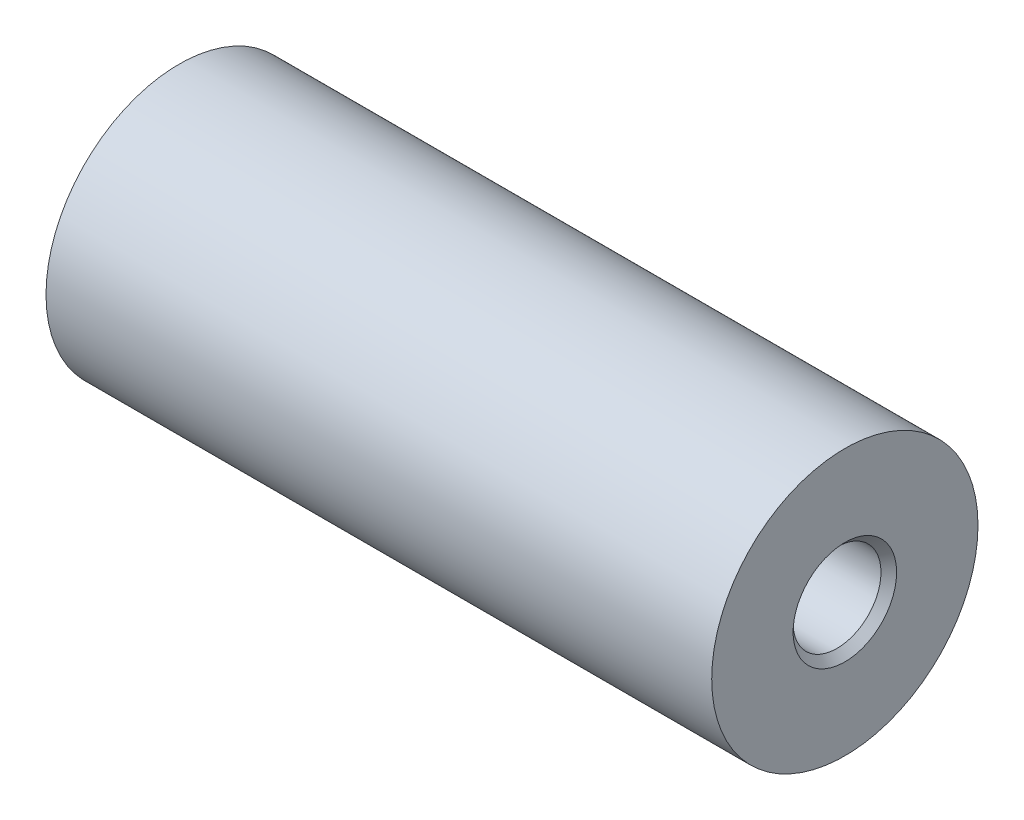
ISO-10303-21;
HEADER;
FILE_DESCRIPTION(('STEP AP214'),'2;1');
FILE_NAME('part.step','',(''),(''),'','','');
FILE_SCHEMA(('AUTOMOTIVE_DESIGN { 1 0 10303 214 1 1 1 1 }'));
ENDSEC;
DATA;
#1=APPLICATION_CONTEXT('core data for automotive mechanical design processes');
#2=APPLICATION_PROTOCOL_DEFINITION('international standard','automotive_design',2000,#1);
#3=PRODUCT_CONTEXT('',#1,'mechanical');
#4=PRODUCT('Part','Part','',(#3));
#5=PRODUCT_RELATED_PRODUCT_CATEGORY('part','',(#4));
#6=PRODUCT_DEFINITION_FORMATION('','',#4);
#7=PRODUCT_DEFINITION_CONTEXT('part definition',#1,'design');
#8=PRODUCT_DEFINITION('design','',#6,#7);
#9=PRODUCT_DEFINITION_SHAPE('','',#8);
#10=(LENGTH_UNIT() NAMED_UNIT(*) SI_UNIT(.MILLI.,.METRE.));
#11=(NAMED_UNIT(*) PLANE_ANGLE_UNIT() SI_UNIT($,.RADIAN.));
#12=(NAMED_UNIT(*) SI_UNIT($,.STERADIAN.) SOLID_ANGLE_UNIT());
#13=UNCERTAINTY_MEASURE_WITH_UNIT(LENGTH_MEASURE(1.E-05),#10,'distance_accuracy_value','');
#14=(GEOMETRIC_REPRESENTATION_CONTEXT(3) GLOBAL_UNCERTAINTY_ASSIGNED_CONTEXT((#13)) GLOBAL_UNIT_ASSIGNED_CONTEXT((#10,
#11,#12)) REPRESENTATION_CONTEXT('',''));
#15=CARTESIAN_POINT('',(0.,0.,0.));
#16=DIRECTION('',(0.,0.,1.));
#17=DIRECTION('',(1.,0.,0.));
#18=AXIS2_PLACEMENT_3D('',#15,#16,#17);
#19=CARTESIAN_POINT('',(50.,0.,0.));
#20=DIRECTION('',(-1.,0.,0.));
#21=DIRECTION('',(0.,0.,1.));
#22=AXIS2_PLACEMENT_3D('',#19,#20,#21);
#23=CYLINDRICAL_SURFACE('',#22,10.);
#24=CARTESIAN_POINT('',(50.,0.,0.));
#25=DIRECTION('',(1.,0.,0.));
#26=DIRECTION('',(0.,0.,-1.));
#27=AXIS2_PLACEMENT_3D('',#24,#25,#26);
#28=CIRCLE('',#27,10.);
#29=CARTESIAN_POINT('',(50.,0.,-10.));
#30=VERTEX_POINT('',#29);
#31=EDGE_CURVE('E10',#30,#30,#28,.T.);
#32=ORIENTED_EDGE('',*,*,#31,.F.);
#33=EDGE_LOOP('',(#32));
#34=FACE_BOUND('',#33,.T.);
#35=CARTESIAN_POINT('',(0.,0.,0.));
#36=DIRECTION('',(1.,0.,0.));
#37=DIRECTION('',(0.,0.,-1.));
#38=AXIS2_PLACEMENT_3D('',#35,#36,#37);
#39=CIRCLE('',#38,10.);
#40=CARTESIAN_POINT('',(0.,0.,-10.));
#41=VERTEX_POINT('',#40);
#42=EDGE_CURVE('E44',#41,#41,#39,.T.);
#43=ORIENTED_EDGE('',*,*,#42,.T.);
#44=EDGE_LOOP('',(#43));
#45=FACE_BOUND('',#44,.T.);
#46=ADVANCED_FACE('F41',(#34,#45),#23,.T.);
#47=CARTESIAN_POINT('',(50.,0.,0.));
#48=DIRECTION('',(1.,0.,0.));
#49=DIRECTION('',(0.,0.,-1.));
#50=AXIS2_PLACEMENT_3D('',#47,#48,#49);
#51=PLANE('',#50);
#52=CARTESIAN_POINT('',(50.,0.,0.));
#53=DIRECTION('',(1.,0.,0.));
#54=DIRECTION('',(0.,0.,-1.));
#55=AXIS2_PLACEMENT_3D('',#52,#53,#54);
#56=CIRCLE('',#55,3.8865);
#57=CARTESIAN_POINT('',(50.,0.,-3.8865));
#58=VERTEX_POINT('',#57);
#59=EDGE_CURVE('E62',#58,#58,#56,.T.);
#60=ORIENTED_EDGE('',*,*,#59,.F.);
#61=EDGE_LOOP('',(#60));
#62=FACE_BOUND('',#61,.T.);
#63=ORIENTED_EDGE('',*,*,#31,.T.);
#64=EDGE_LOOP('',(#63));
#65=FACE_BOUND('',#64,.T.);
#66=ADVANCED_FACE('F69',(#62,#65),#51,.T.);
#67=CARTESIAN_POINT('',(0.,0.,0.));
#68=DIRECTION('',(1.,0.,0.));
#69=DIRECTION('',(0.,0.,-1.));
#70=AXIS2_PLACEMENT_3D('',#67,#68,#69);
#71=PLANE('',#70);
#72=CARTESIAN_POINT('',(0.,0.,0.));
#73=DIRECTION('',(1.,0.,0.));
#74=DIRECTION('',(0.,0.,-1.));
#75=AXIS2_PLACEMENT_3D('',#72,#73,#74);
#76=CIRCLE('',#75,3.29999999999999);
#77=CARTESIAN_POINT('',(0.,0.,-3.29999999999999));
#78=VERTEX_POINT('',#77);
#79=EDGE_CURVE('E53',#78,#78,#76,.T.);
#80=ORIENTED_EDGE('',*,*,#79,.T.);
#81=EDGE_LOOP('',(#80));
#82=FACE_BOUND('',#81,.T.);
#83=ORIENTED_EDGE('',*,*,#42,.F.);
#84=EDGE_LOOP('',(#83));
#85=FACE_BOUND('',#84,.T.);
#86=ADVANCED_FACE('F71',(#82,#85),#71,.F.);
#87=CARTESIAN_POINT('',(50.,0.,0.));
#88=DIRECTION('',(1.,0.,0.));
#89=DIRECTION('',(0.,0.,-1.));
#90=AXIS2_PLACEMENT_3D('',#87,#88,#89);
#91=CYLINDRICAL_SURFACE('',#90,3.29999999999999);
#92=ORIENTED_EDGE('',*,*,#79,.F.);
#93=EDGE_LOOP('',(#92));
#94=FACE_BOUND('',#93,.T.);
#95=CARTESIAN_POINT('',(49.4135,0.,0.));
#96=DIRECTION('',(1.,0.,0.));
#97=DIRECTION('',(0.,0.,-1.));
#98=AXIS2_PLACEMENT_3D('',#95,#96,#97);
#99=CIRCLE('',#98,3.29999999999999);
#100=CARTESIAN_POINT('',(49.4135,0.,-3.29999999999999));
#101=VERTEX_POINT('',#100);
#102=EDGE_CURVE('E58',#101,#101,#99,.T.);
#103=ORIENTED_EDGE('',*,*,#102,.T.);
#104=EDGE_LOOP('',(#103));
#105=FACE_BOUND('',#104,.T.);
#106=ADVANCED_FACE('F77',(#94,#105),#91,.F.);
#107=CARTESIAN_POINT('',(50.,0.,0.));
#108=DIRECTION('',(1.,0.,0.));
#109=DIRECTION('',(0.,0.,-1.));
#110=AXIS2_PLACEMENT_3D('',#107,#108,#109);
#111=CONICAL_SURFACE('',#110,3.8865,0.785398163397442);
#112=ORIENTED_EDGE('',*,*,#102,.F.);
#113=EDGE_LOOP('',(#112));
#114=FACE_BOUND('',#113,.T.);
#115=ORIENTED_EDGE('',*,*,#59,.T.);
#116=EDGE_LOOP('',(#115));
#117=FACE_BOUND('',#116,.T.);
#118=ADVANCED_FACE('F67',(#114,#117),#111,.F.);
#119=CLOSED_SHELL('',(#46,#66,#86,#106,#118));
#120=MANIFOLD_SOLID_BREP('B2',#119);
#121=ADVANCED_BREP_SHAPE_REPRESENTATION('',(#18,#120),#14);
#122=SHAPE_DEFINITION_REPRESENTATION(#9,#121);
ENDSEC;
END-ISO-10303-21;
